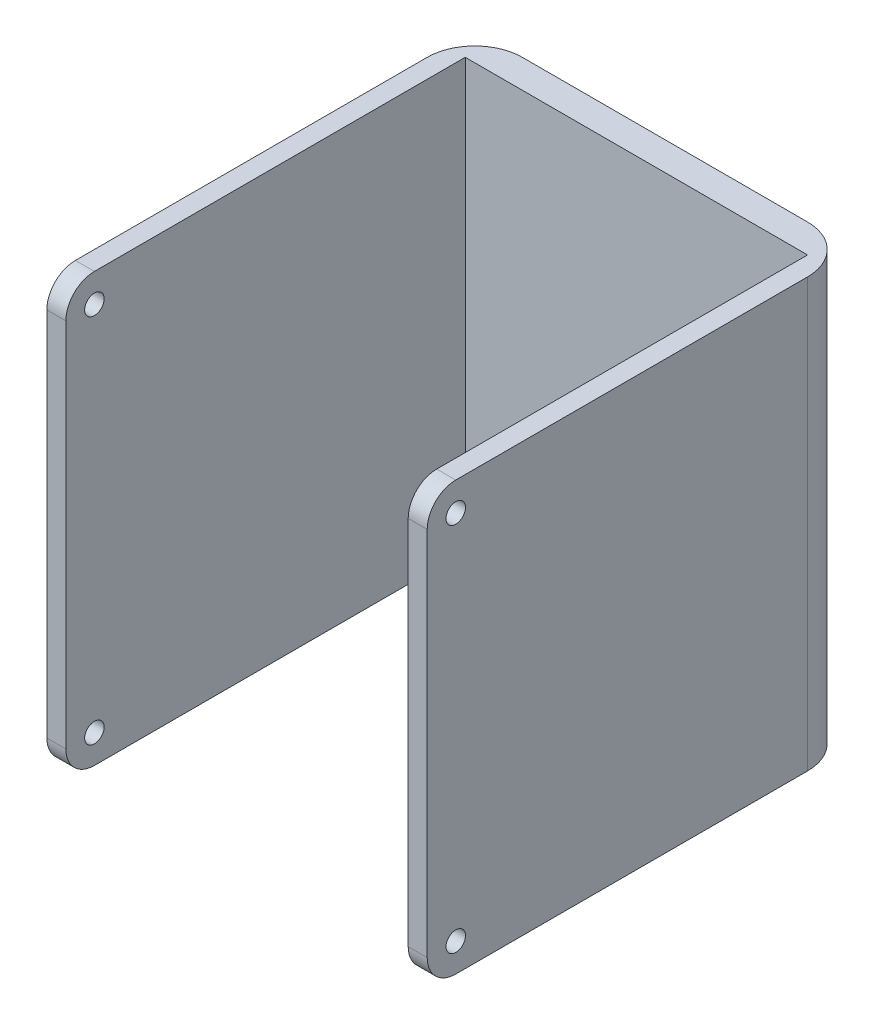
ISO-10303-21;
HEADER;
FILE_DESCRIPTION(('STEP AP214'),'2;1');
FILE_NAME('part.step','',(''),(''),'','','');
FILE_SCHEMA(('AUTOMOTIVE_DESIGN { 1 0 10303 214 1 1 1 1 }'));
ENDSEC;
DATA;
#1=APPLICATION_CONTEXT('core data for automotive mechanical design processes');
#2=APPLICATION_PROTOCOL_DEFINITION('international standard','automotive_design',2000,#1);
#3=PRODUCT_CONTEXT('',#1,'mechanical');
#4=PRODUCT('Part','Part','',(#3));
#5=PRODUCT_RELATED_PRODUCT_CATEGORY('part','',(#4));
#6=PRODUCT_DEFINITION_FORMATION('','',#4);
#7=PRODUCT_DEFINITION_CONTEXT('part definition',#1,'design');
#8=PRODUCT_DEFINITION('design','',#6,#7);
#9=PRODUCT_DEFINITION_SHAPE('','',#8);
#10=(LENGTH_UNIT() NAMED_UNIT(*) SI_UNIT(.MILLI.,.METRE.));
#11=(NAMED_UNIT(*) PLANE_ANGLE_UNIT() SI_UNIT($,.RADIAN.));
#12=(NAMED_UNIT(*) SI_UNIT($,.STERADIAN.) SOLID_ANGLE_UNIT());
#13=UNCERTAINTY_MEASURE_WITH_UNIT(LENGTH_MEASURE(1.E-05),#10,'distance_accuracy_value','');
#14=(GEOMETRIC_REPRESENTATION_CONTEXT(3) GLOBAL_UNCERTAINTY_ASSIGNED_CONTEXT((#13)) GLOBAL_UNIT_ASSIGNED_CONTEXT((#10,
#11,#12)) REPRESENTATION_CONTEXT('',''));
#15=CARTESIAN_POINT('',(0.,0.,0.));
#16=DIRECTION('',(0.,0.,1.));
#17=DIRECTION('',(1.,0.,0.));
#18=AXIS2_PLACEMENT_3D('',#15,#16,#17);
#19=CARTESIAN_POINT('',(-14.5454545454545,13.9090909090909,37.));
#20=DIRECTION('',(1.,0.,0.));
#21=DIRECTION('',(0.,0.,-1.));
#22=AXIS2_PLACEMENT_3D('',#19,#20,#21);
#23=CYLINDRICAL_SURFACE('',#22,3.);
#24=DIRECTION('',(1.,0.,0.));
#25=VECTOR('',#24,1.);
#26=CARTESIAN_POINT('',(-14.5454545454545,16.9090909090909,37.));
#27=LINE('',#26,#25);
#28=CARTESIAN_POINT('',(23.4545454545455,16.9090909090909,37.));
#29=VERTEX_POINT('',#28);
#30=CARTESIAN_POINT('',(25.4545454545455,16.9090909090909,37.));
#31=VERTEX_POINT('',#30);
#32=EDGE_CURVE('E265',#29,#31,#27,.T.);
#33=ORIENTED_EDGE('',*,*,#32,.F.);
#34=CARTESIAN_POINT('',(23.4545454545455,13.9090909090909,37.));
#35=DIRECTION('',(1.,0.,0.));
#36=DIRECTION('',(0.,0.,-1.));
#37=AXIS2_PLACEMENT_3D('',#34,#35,#36);
#38=CIRCLE('',#37,3.);
#39=CARTESIAN_POINT('',(23.4545454545455,13.9090909090909,40.));
#40=VERTEX_POINT('',#39);
#41=EDGE_CURVE('E45',#40,#29,#38,.F.);
#42=ORIENTED_EDGE('',*,*,#41,.F.);
#43=DIRECTION('',(1.,0.,0.));
#44=VECTOR('',#43,1.);
#45=CARTESIAN_POINT('',(0.,13.9090909090909,40.));
#46=LINE('',#45,#44);
#47=CARTESIAN_POINT('',(25.4545454545455,13.9090909090909,40.));
#48=VERTEX_POINT('',#47);
#49=EDGE_CURVE('E268',#48,#40,#46,.F.);
#50=ORIENTED_EDGE('',*,*,#49,.F.);
#51=CARTESIAN_POINT('',(25.4545454545455,13.9090909090909,37.));
#52=DIRECTION('',(-1.,0.,0.));
#53=DIRECTION('',(0.,-1.,0.));
#54=AXIS2_PLACEMENT_3D('',#51,#52,#53);
#55=CIRCLE('',#54,3.);
#56=EDGE_CURVE('E11',#31,#48,#55,.F.);
#57=ORIENTED_EDGE('',*,*,#56,.F.);
#58=EDGE_LOOP('',(#33,#42,#50,#57));
#59=FACE_BOUND('',#58,.T.);
#60=ADVANCED_FACE('F38',(#59),#23,.T.);
#61=CARTESIAN_POINT('',(-14.5454545454545,13.9090909090909,37.));
#62=DIRECTION('',(1.,0.,0.));
#63=DIRECTION('',(0.,0.,-1.));
#64=AXIS2_PLACEMENT_3D('',#61,#62,#63);
#65=CYLINDRICAL_SURFACE('',#64,3.);
#66=DIRECTION('',(1.,0.,0.));
#67=VECTOR('',#66,1.);
#68=CARTESIAN_POINT('',(-14.5454545454545,16.9090909090909,37.));
#69=LINE('',#68,#67);
#70=CARTESIAN_POINT('',(-14.5454545454545,16.9090909090909,37.));
#71=VERTEX_POINT('',#70);
#72=CARTESIAN_POINT('',(-12.5454545454545,16.9090909090909,37.));
#73=VERTEX_POINT('',#72);
#74=EDGE_CURVE('E254',#71,#73,#69,.T.);
#75=ORIENTED_EDGE('',*,*,#74,.F.);
#76=CARTESIAN_POINT('',(-14.5454545454545,13.9090909090909,37.));
#77=DIRECTION('',(-1.,0.,0.));
#78=DIRECTION('',(0.,-1.,0.));
#79=AXIS2_PLACEMENT_3D('',#76,#77,#78);
#80=CIRCLE('',#79,3.);
#81=CARTESIAN_POINT('',(-14.5454545454545,13.9090909090909,40.));
#82=VERTEX_POINT('',#81);
#83=EDGE_CURVE('E263',#82,#71,#80,.T.);
#84=ORIENTED_EDGE('',*,*,#83,.F.);
#85=DIRECTION('',(1.,0.,0.));
#86=VECTOR('',#85,1.);
#87=CARTESIAN_POINT('',(0.,13.9090909090909,40.));
#88=LINE('',#87,#86);
#89=CARTESIAN_POINT('',(-12.5454545454545,13.9090909090909,40.));
#90=VERTEX_POINT('',#89);
#91=EDGE_CURVE('E260',#90,#82,#88,.F.);
#92=ORIENTED_EDGE('',*,*,#91,.F.);
#93=CARTESIAN_POINT('',(-12.5454545454545,13.9090909090909,37.));
#94=DIRECTION('',(-1.,0.,0.));
#95=DIRECTION('',(0.,0.,1.));
#96=AXIS2_PLACEMENT_3D('',#93,#94,#95);
#97=CIRCLE('',#96,3.);
#98=EDGE_CURVE('E257',#73,#90,#97,.F.);
#99=ORIENTED_EDGE('',*,*,#98,.F.);
#100=EDGE_LOOP('',(#75,#84,#92,#99));
#101=FACE_BOUND('',#100,.T.);
#102=ADVANCED_FACE('F325',(#101),#65,.T.);
#103=CARTESIAN_POINT('',(-14.5454545454545,-25.0909090909091,37.));
#104=DIRECTION('',(1.,0.,0.));
#105=DIRECTION('',(0.,0.,-1.));
#106=AXIS2_PLACEMENT_3D('',#103,#104,#105);
#107=CYLINDRICAL_SURFACE('',#106,3.);
#108=DIRECTION('',(-1.,0.,0.));
#109=VECTOR('',#108,1.);
#110=CARTESIAN_POINT('',(-14.5454545454545,-28.0909090909091,37.));
#111=LINE('',#110,#109);
#112=CARTESIAN_POINT('',(25.4545454545455,-28.0909090909091,37.));
#113=VERTEX_POINT('',#112);
#114=CARTESIAN_POINT('',(23.4545454545455,-28.0909090909091,37.));
#115=VERTEX_POINT('',#114);
#116=EDGE_CURVE('E243',#113,#115,#111,.T.);
#117=ORIENTED_EDGE('',*,*,#116,.F.);
#118=CARTESIAN_POINT('',(25.4545454545455,-25.0909090909091,37.));
#119=DIRECTION('',(-1.,0.,0.));
#120=DIRECTION('',(0.,-1.,0.));
#121=AXIS2_PLACEMENT_3D('',#118,#119,#120);
#122=CIRCLE('',#121,3.);
#123=CARTESIAN_POINT('',(25.4545454545455,-25.0909090909091,40.));
#124=VERTEX_POINT('',#123);
#125=EDGE_CURVE('E249',#124,#113,#122,.F.);
#126=ORIENTED_EDGE('',*,*,#125,.F.);
#127=DIRECTION('',(-1.,0.,0.));
#128=VECTOR('',#127,1.);
#129=CARTESIAN_POINT('',(-14.5454545454545,-25.0909090909091,40.));
#130=LINE('',#129,#128);
#131=CARTESIAN_POINT('',(23.4545454545455,-25.0909090909091,40.));
#132=VERTEX_POINT('',#131);
#133=EDGE_CURVE('E246',#132,#124,#130,.F.);
#134=ORIENTED_EDGE('',*,*,#133,.F.);
#135=CARTESIAN_POINT('',(23.4545454545455,-25.0909090909091,37.));
#136=DIRECTION('',(1.,0.,0.));
#137=DIRECTION('',(0.,0.,-1.));
#138=AXIS2_PLACEMENT_3D('',#135,#136,#137);
#139=CIRCLE('',#138,3.);
#140=EDGE_CURVE('E251',#115,#132,#139,.F.);
#141=ORIENTED_EDGE('',*,*,#140,.F.);
#142=EDGE_LOOP('',(#117,#126,#134,#141));
#143=FACE_BOUND('',#142,.T.);
#144=ADVANCED_FACE('F329',(#143),#107,.T.);
#145=CARTESIAN_POINT('',(-14.5454545454545,-25.0909090909091,37.));
#146=DIRECTION('',(1.,0.,0.));
#147=DIRECTION('',(0.,0.,-1.));
#148=AXIS2_PLACEMENT_3D('',#145,#146,#147);
#149=CYLINDRICAL_SURFACE('',#148,3.);
#150=DIRECTION('',(-1.,0.,0.));
#151=VECTOR('',#150,1.);
#152=CARTESIAN_POINT('',(-14.5454545454545,-28.0909090909091,37.));
#153=LINE('',#152,#151);
#154=CARTESIAN_POINT('',(-12.5454545454545,-28.0909090909091,37.));
#155=VERTEX_POINT('',#154);
#156=CARTESIAN_POINT('',(-14.5454545454545,-28.0909090909091,37.));
#157=VERTEX_POINT('',#156);
#158=EDGE_CURVE('E232',#155,#157,#153,.T.);
#159=ORIENTED_EDGE('',*,*,#158,.F.);
#160=CARTESIAN_POINT('',(-12.5454545454545,-25.0909090909091,37.));
#161=DIRECTION('',(-1.,0.,0.));
#162=DIRECTION('',(0.,0.,1.));
#163=AXIS2_PLACEMENT_3D('',#160,#161,#162);
#164=CIRCLE('',#163,3.);
#165=CARTESIAN_POINT('',(-12.5454545454545,-25.0909090909091,40.));
#166=VERTEX_POINT('',#165);
#167=EDGE_CURVE('E238',#166,#155,#164,.F.);
#168=ORIENTED_EDGE('',*,*,#167,.F.);
#169=DIRECTION('',(-1.,0.,0.));
#170=VECTOR('',#169,1.);
#171=CARTESIAN_POINT('',(-14.5454545454545,-25.0909090909091,40.));
#172=LINE('',#171,#170);
#173=CARTESIAN_POINT('',(-14.5454545454545,-25.0909090909091,40.));
#174=VERTEX_POINT('',#173);
#175=EDGE_CURVE('E235',#174,#166,#172,.F.);
#176=ORIENTED_EDGE('',*,*,#175,.F.);
#177=CARTESIAN_POINT('',(-14.5454545454545,-25.0909090909091,37.));
#178=DIRECTION('',(-1.,0.,0.));
#179=DIRECTION('',(0.,-1.,0.));
#180=AXIS2_PLACEMENT_3D('',#177,#178,#179);
#181=CIRCLE('',#180,3.);
#182=EDGE_CURVE('E240',#157,#174,#181,.T.);
#183=ORIENTED_EDGE('',*,*,#182,.F.);
#184=EDGE_LOOP('',(#159,#168,#176,#183));
#185=FACE_BOUND('',#184,.T.);
#186=ADVANCED_FACE('F334',(#185),#149,.T.);
#187=CARTESIAN_POINT('',(20.4545454545455,0.,0.));
#188=DIRECTION('',(0.,1.,0.));
#189=DIRECTION('',(-1.,0.,0.));
#190=AXIS2_PLACEMENT_3D('',#187,#188,#189);
#191=CYLINDRICAL_SURFACE('',#190,5.);
#192=DIRECTION('',(0.,-1.,0.));
#193=VECTOR('',#192,1.);
#194=CARTESIAN_POINT('',(20.4545454545455,0.,-5.));
#195=LINE('',#194,#193);
#196=CARTESIAN_POINT('',(20.4545454545455,16.9090909090909,-5.));
#197=VERTEX_POINT('',#196);
#198=CARTESIAN_POINT('',(20.4545454545455,-28.0909090909091,-5.));
#199=VERTEX_POINT('',#198);
#200=EDGE_CURVE('E222',#197,#199,#195,.T.);
#201=ORIENTED_EDGE('',*,*,#200,.F.);
#202=CARTESIAN_POINT('',(20.4545454545455,16.9090909090909,0.));
#203=DIRECTION('',(0.,-1.,0.));
#204=DIRECTION('',(0.,0.,-1.));
#205=AXIS2_PLACEMENT_3D('',#202,#203,#204);
#206=CIRCLE('',#205,5.);
#207=CARTESIAN_POINT('',(25.4545454545455,16.9090909090909,0.));
#208=VERTEX_POINT('',#207);
#209=EDGE_CURVE('E228',#208,#197,#206,.F.);
#210=ORIENTED_EDGE('',*,*,#209,.F.);
#211=DIRECTION('',(0.,-1.,0.));
#212=VECTOR('',#211,1.);
#213=CARTESIAN_POINT('',(25.4545454545455,0.,0.));
#214=LINE('',#213,#212);
#215=CARTESIAN_POINT('',(25.4545454545455,-28.0909090909091,0.));
#216=VERTEX_POINT('',#215);
#217=EDGE_CURVE('E225',#216,#208,#214,.F.);
#218=ORIENTED_EDGE('',*,*,#217,.F.);
#219=CARTESIAN_POINT('',(20.4545454545455,-28.0909090909091,0.));
#220=DIRECTION('',(0.,-1.,0.));
#221=DIRECTION('',(0.,0.,-1.));
#222=AXIS2_PLACEMENT_3D('',#219,#220,#221);
#223=CIRCLE('',#222,5.);
#224=EDGE_CURVE('E230',#199,#216,#223,.T.);
#225=ORIENTED_EDGE('',*,*,#224,.F.);
#226=EDGE_LOOP('',(#201,#210,#218,#225));
#227=FACE_BOUND('',#226,.T.);
#228=ADVANCED_FACE('F341',(#227),#191,.T.);
#229=CARTESIAN_POINT('',(-9.54545454545454,0.,0.));
#230=DIRECTION('',(0.,1.,0.));
#231=DIRECTION('',(-1.,0.,0.));
#232=AXIS2_PLACEMENT_3D('',#229,#230,#231);
#233=CYLINDRICAL_SURFACE('',#232,5.);
#234=DIRECTION('',(0.,1.,0.));
#235=VECTOR('',#234,1.);
#236=CARTESIAN_POINT('',(-9.54545454545454,0.,-5.));
#237=LINE('',#236,#235);
#238=CARTESIAN_POINT('',(-9.54545454545454,-28.0909090909091,-5.));
#239=VERTEX_POINT('',#238);
#240=CARTESIAN_POINT('',(-9.54545454545455,16.9090909090909,-5.));
#241=VERTEX_POINT('',#240);
#242=EDGE_CURVE('E212',#239,#241,#237,.T.);
#243=ORIENTED_EDGE('',*,*,#242,.F.);
#244=CARTESIAN_POINT('',(-9.54545454545454,-28.0909090909091,0.));
#245=DIRECTION('',(0.,-1.,0.));
#246=DIRECTION('',(0.,0.,-1.));
#247=AXIS2_PLACEMENT_3D('',#244,#245,#246);
#248=CIRCLE('',#247,5.);
#249=CARTESIAN_POINT('',(-14.5454545454545,-28.0909090909091,0.));
#250=VERTEX_POINT('',#249);
#251=EDGE_CURVE('E218',#250,#239,#248,.T.);
#252=ORIENTED_EDGE('',*,*,#251,.F.);
#253=DIRECTION('',(0.,1.,0.));
#254=VECTOR('',#253,1.);
#255=CARTESIAN_POINT('',(-14.5454545454545,16.9090909090909,0.));
#256=LINE('',#255,#254);
#257=CARTESIAN_POINT('',(-14.5454545454545,16.9090909090909,0.));
#258=VERTEX_POINT('',#257);
#259=EDGE_CURVE('E215',#258,#250,#256,.F.);
#260=ORIENTED_EDGE('',*,*,#259,.F.);
#261=CARTESIAN_POINT('',(-9.54545454545454,16.9090909090909,0.));
#262=DIRECTION('',(0.,-1.,0.));
#263=DIRECTION('',(0.,0.,-1.));
#264=AXIS2_PLACEMENT_3D('',#261,#262,#263);
#265=CIRCLE('',#264,5.);
#266=EDGE_CURVE('E220',#241,#258,#265,.F.);
#267=ORIENTED_EDGE('',*,*,#266,.F.);
#268=EDGE_LOOP('',(#243,#252,#260,#267));
#269=FACE_BOUND('',#268,.T.);
#270=ADVANCED_FACE('F345',(#269),#233,.T.);
#271=CARTESIAN_POINT('',(0.,0.,40.));
#272=DIRECTION('',(0.,0.,-1.));
#273=DIRECTION('',(-1.,0.,0.));
#274=AXIS2_PLACEMENT_3D('',#271,#272,#273);
#275=PLANE('',#274);
#276=DIRECTION('',(0.,1.,0.));
#277=VECTOR('',#276,1.);
#278=CARTESIAN_POINT('',(-12.5454545454545,0.,40.));
#279=LINE('',#278,#277);
#280=EDGE_CURVE('E207',#166,#90,#279,.T.);
#281=ORIENTED_EDGE('',*,*,#280,.T.);
#282=ORIENTED_EDGE('',*,*,#91,.T.);
#283=DIRECTION('',(0.,-1.,0.));
#284=VECTOR('',#283,1.);
#285=CARTESIAN_POINT('',(-14.5454545454545,16.9090909090909,40.));
#286=LINE('',#285,#284);
#287=EDGE_CURVE('E186',#82,#174,#286,.T.);
#288=ORIENTED_EDGE('',*,*,#287,.T.);
#289=ORIENTED_EDGE('',*,*,#175,.T.);
#290=EDGE_LOOP('',(#281,#282,#288,#289));
#291=FACE_BOUND('',#290,.T.);
#292=ADVANCED_FACE('F349',(#291),#275,.F.);
#293=CARTESIAN_POINT('',(-14.5454545454545,16.9090909090909,-5.));
#294=DIRECTION('',(0.,-1.,0.));
#295=DIRECTION('',(0.,0.,-1.));
#296=AXIS2_PLACEMENT_3D('',#293,#294,#295);
#297=PLANE('',#296);
#298=DIRECTION('',(0.,0.,-1.));
#299=VECTOR('',#298,1.);
#300=CARTESIAN_POINT('',(23.4545454545455,16.9090909090909,3.));
#301=LINE('',#300,#299);
#302=CARTESIAN_POINT('',(23.4545454545454,16.9090909090909,-2.));
#303=VERTEX_POINT('',#302);
#304=EDGE_CURVE('E178',#29,#303,#301,.T.);
#305=ORIENTED_EDGE('',*,*,#304,.F.);
#306=ORIENTED_EDGE('',*,*,#32,.T.);
#307=DIRECTION('',(0.,0.,1.));
#308=VECTOR('',#307,1.);
#309=CARTESIAN_POINT('',(25.4545454545455,16.9090909090909,-5.));
#310=LINE('',#309,#308);
#311=EDGE_CURVE('E203',#208,#31,#310,.T.);
#312=ORIENTED_EDGE('',*,*,#311,.F.);
#313=ORIENTED_EDGE('',*,*,#209,.T.);
#314=DIRECTION('',(1.,0.,0.));
#315=VECTOR('',#314,1.);
#316=CARTESIAN_POINT('',(-14.5454545454545,16.9090909090909,-5.));
#317=LINE('',#316,#315);
#318=EDGE_CURVE('E188',#241,#197,#317,.T.);
#319=ORIENTED_EDGE('',*,*,#318,.F.);
#320=ORIENTED_EDGE('',*,*,#266,.T.);
#321=DIRECTION('',(0.,0.,1.));
#322=VECTOR('',#321,1.);
#323=CARTESIAN_POINT('',(-14.5454545454545,16.9090909090909,-5.));
#324=LINE('',#323,#322);
#325=EDGE_CURVE('E194',#258,#71,#324,.T.);
#326=ORIENTED_EDGE('',*,*,#325,.T.);
#327=ORIENTED_EDGE('',*,*,#74,.T.);
#328=DIRECTION('',(0.,0.,1.));
#329=VECTOR('',#328,1.);
#330=CARTESIAN_POINT('',(-12.5454545454545,16.9090909090909,3.));
#331=LINE('',#330,#329);
#332=CARTESIAN_POINT('',(-12.5454545454545,16.9090909090909,-2.));
#333=VERTEX_POINT('',#332);
#334=EDGE_CURVE('E279',#333,#73,#331,.T.);
#335=ORIENTED_EDGE('',*,*,#334,.F.);
#336=DIRECTION('',(-1.,0.,0.));
#337=VECTOR('',#336,1.);
#338=CARTESIAN_POINT('',(-12.5454545454545,16.9090909090909,-2.));
#339=LINE('',#338,#337);
#340=EDGE_CURVE('E158',#303,#333,#339,.T.);
#341=ORIENTED_EDGE('',*,*,#340,.F.);
#342=EDGE_LOOP('',(#305,#306,#312,#313,#319,#320,#326,#327,#335,#341));
#343=FACE_BOUND('',#342,.T.);
#344=ADVANCED_FACE('F277',(#343),#297,.F.);
#345=CARTESIAN_POINT('',(25.4545454545455,16.9090909090909,-5.));
#346=DIRECTION('',(-1.,0.,0.));
#347=DIRECTION('',(0.,-1.,0.));
#348=AXIS2_PLACEMENT_3D('',#345,#346,#347);
#349=PLANE('',#348);
#350=CARTESIAN_POINT('',(25.4545454545455,13.9090909090909,37.));
#351=DIRECTION('',(1.,0.,0.));
#352=DIRECTION('',(0.,1.,0.));
#353=AXIS2_PLACEMENT_3D('',#350,#351,#352);
#354=CIRCLE('',#353,1.025);
#355=CARTESIAN_POINT('',(25.4545454545455,14.9340909090909,37.));
#356=VERTEX_POINT('',#355);
#357=EDGE_CURVE('E301',#356,#356,#354,.T.);
#358=ORIENTED_EDGE('',*,*,#357,.F.);
#359=EDGE_LOOP('',(#358));
#360=FACE_BOUND('',#359,.T.);
#361=CARTESIAN_POINT('',(25.4545454545455,-25.0909090909091,37.));
#362=DIRECTION('',(1.,0.,0.));
#363=DIRECTION('',(0.,1.,0.));
#364=AXIS2_PLACEMENT_3D('',#361,#362,#363);
#365=CIRCLE('',#364,1.025);
#366=CARTESIAN_POINT('',(25.4545454545455,-24.0659090909091,37.));
#367=VERTEX_POINT('',#366);
#368=EDGE_CURVE('E294',#367,#367,#365,.T.);
#369=ORIENTED_EDGE('',*,*,#368,.F.);
#370=EDGE_LOOP('',(#369));
#371=FACE_BOUND('',#370,.T.);
#372=ORIENTED_EDGE('',*,*,#311,.T.);
#373=ORIENTED_EDGE('',*,*,#56,.T.);
#374=DIRECTION('',(0.,-1.,0.));
#375=VECTOR('',#374,1.);
#376=CARTESIAN_POINT('',(25.4545454545455,16.9090909090909,40.));
#377=LINE('',#376,#375);
#378=EDGE_CURVE('E184',#48,#124,#377,.T.);
#379=ORIENTED_EDGE('',*,*,#378,.T.);
#380=ORIENTED_EDGE('',*,*,#125,.T.);
#381=DIRECTION('',(0.,0.,1.));
#382=VECTOR('',#381,1.);
#383=CARTESIAN_POINT('',(25.4545454545455,-28.0909090909091,-5.));
#384=LINE('',#383,#382);
#385=EDGE_CURVE('E200',#216,#113,#384,.T.);
#386=ORIENTED_EDGE('',*,*,#385,.F.);
#387=ORIENTED_EDGE('',*,*,#217,.T.);
#388=EDGE_LOOP('',(#372,#373,#379,#380,#386,#387));
#389=FACE_BOUND('',#388,.T.);
#390=ADVANCED_FACE('F353',(#360,#371,#389),#349,.F.);
#391=CARTESIAN_POINT('',(-14.5454545454545,-28.0909090909091,-5.));
#392=DIRECTION('',(0.,-1.,0.));
#393=DIRECTION('',(0.,0.,-1.));
#394=AXIS2_PLACEMENT_3D('',#391,#392,#393);
#395=PLANE('',#394);
#396=ORIENTED_EDGE('',*,*,#385,.T.);
#397=ORIENTED_EDGE('',*,*,#116,.T.);
#398=DIRECTION('',(0.,0.,1.));
#399=VECTOR('',#398,1.);
#400=CARTESIAN_POINT('',(23.4545454545455,-28.0909090909091,-5.00000000000001));
#401=LINE('',#400,#399);
#402=CARTESIAN_POINT('',(23.4545454545455,-28.0909090909091,3.));
#403=VERTEX_POINT('',#402);
#404=EDGE_CURVE('E174',#403,#115,#401,.T.);
#405=ORIENTED_EDGE('',*,*,#404,.F.);
#406=DIRECTION('',(1.,0.,0.));
#407=VECTOR('',#406,1.);
#408=CARTESIAN_POINT('',(-14.5454545454545,-28.0909090909091,3.));
#409=LINE('',#408,#407);
#410=CARTESIAN_POINT('',(-12.5454545454545,-28.0909090909091,3.));
#411=VERTEX_POINT('',#410);
#412=EDGE_CURVE('E210',#411,#403,#409,.T.);
#413=ORIENTED_EDGE('',*,*,#412,.F.);
#414=DIRECTION('',(0.,0.,-1.));
#415=VECTOR('',#414,1.);
#416=CARTESIAN_POINT('',(-12.5454545454545,-28.0909090909091,-5.));
#417=LINE('',#416,#415);
#418=EDGE_CURVE('E173',#155,#411,#417,.T.);
#419=ORIENTED_EDGE('',*,*,#418,.F.);
#420=ORIENTED_EDGE('',*,*,#158,.T.);
#421=DIRECTION('',(0.,0.,1.));
#422=VECTOR('',#421,1.);
#423=CARTESIAN_POINT('',(-14.5454545454545,-28.0909090909091,-5.));
#424=LINE('',#423,#422);
#425=EDGE_CURVE('E197',#250,#157,#424,.T.);
#426=ORIENTED_EDGE('',*,*,#425,.F.);
#427=ORIENTED_EDGE('',*,*,#251,.T.);
#428=DIRECTION('',(1.,0.,0.));
#429=VECTOR('',#428,1.);
#430=CARTESIAN_POINT('',(-14.5454545454545,-28.0909090909091,-5.));
#431=LINE('',#430,#429);
#432=EDGE_CURVE('E191',#239,#199,#431,.T.);
#433=ORIENTED_EDGE('',*,*,#432,.T.);
#434=ORIENTED_EDGE('',*,*,#224,.T.);
#435=EDGE_LOOP('',(#396,#397,#405,#413,#419,#420,#426,#427,#433,#434));
#436=FACE_BOUND('',#435,.T.);
#437=ADVANCED_FACE('F356',(#436),#395,.T.);
#438=CARTESIAN_POINT('',(-14.5454545454545,16.9090909090909,-5.));
#439=DIRECTION('',(-1.,0.,0.));
#440=DIRECTION('',(0.,-1.,0.));
#441=AXIS2_PLACEMENT_3D('',#438,#439,#440);
#442=PLANE('',#441);
#443=CARTESIAN_POINT('',(-14.5454545454545,13.9090909090909,37.));
#444=DIRECTION('',(-1.,0.,0.));
#445=DIRECTION('',(0.,-1.,0.));
#446=AXIS2_PLACEMENT_3D('',#443,#444,#445);
#447=CIRCLE('',#446,1.025);
#448=CARTESIAN_POINT('',(-14.5454545454545,12.8840909090909,37.));
#449=VERTEX_POINT('',#448);
#450=EDGE_CURVE('E282',#449,#449,#447,.T.);
#451=ORIENTED_EDGE('',*,*,#450,.F.);
#452=EDGE_LOOP('',(#451));
#453=FACE_BOUND('',#452,.T.);
#454=CARTESIAN_POINT('',(-14.5454545454545,-25.0909090909091,37.));
#455=DIRECTION('',(-1.,0.,0.));
#456=DIRECTION('',(0.,-1.,0.));
#457=AXIS2_PLACEMENT_3D('',#454,#455,#456);
#458=CIRCLE('',#457,1.025);
#459=CARTESIAN_POINT('',(-14.5454545454545,-26.1159090909091,37.));
#460=VERTEX_POINT('',#459);
#461=EDGE_CURVE('E285',#460,#460,#458,.T.);
#462=ORIENTED_EDGE('',*,*,#461,.F.);
#463=EDGE_LOOP('',(#462));
#464=FACE_BOUND('',#463,.T.);
#465=ORIENTED_EDGE('',*,*,#287,.F.);
#466=ORIENTED_EDGE('',*,*,#83,.T.);
#467=ORIENTED_EDGE('',*,*,#325,.F.);
#468=ORIENTED_EDGE('',*,*,#259,.T.);
#469=ORIENTED_EDGE('',*,*,#425,.T.);
#470=ORIENTED_EDGE('',*,*,#182,.T.);
#471=EDGE_LOOP('',(#465,#466,#467,#468,#469,#470));
#472=FACE_BOUND('',#471,.T.);
#473=ADVANCED_FACE('F360',(#453,#464,#472),#442,.T.);
#474=CARTESIAN_POINT('',(0.,0.,-5.));
#475=DIRECTION('',(0.,0.,-1.));
#476=DIRECTION('',(-1.,0.,0.));
#477=AXIS2_PLACEMENT_3D('',#474,#475,#476);
#478=PLANE('',#477);
#479=ORIENTED_EDGE('',*,*,#318,.T.);
#480=ORIENTED_EDGE('',*,*,#200,.T.);
#481=ORIENTED_EDGE('',*,*,#432,.F.);
#482=ORIENTED_EDGE('',*,*,#242,.T.);
#483=EDGE_LOOP('',(#479,#480,#481,#482));
#484=FACE_BOUND('',#483,.T.);
#485=ADVANCED_FACE('F364',(#484),#478,.T.);
#486=ORIENTED_EDGE('',*,*,#378,.F.);
#487=ORIENTED_EDGE('',*,*,#49,.T.);
#488=DIRECTION('',(0.,-1.,0.));
#489=VECTOR('',#488,1.);
#490=CARTESIAN_POINT('',(23.4545454545455,0.,40.));
#491=LINE('',#490,#489);
#492=EDGE_CURVE('E205',#40,#132,#491,.T.);
#493=ORIENTED_EDGE('',*,*,#492,.T.);
#494=ORIENTED_EDGE('',*,*,#133,.T.);
#495=EDGE_LOOP('',(#486,#487,#493,#494));
#496=FACE_BOUND('',#495,.T.);
#497=ADVANCED_FACE('F368',(#496),#275,.F.);
#498=CARTESIAN_POINT('',(-12.5454545454545,-33.0909090909091,3.));
#499=DIRECTION('',(-1.,0.,0.));
#500=DIRECTION('',(0.,0.,1.));
#501=AXIS2_PLACEMENT_3D('',#498,#499,#500);
#502=PLANE('',#501);
#503=CARTESIAN_POINT('',(-12.5454545454545,13.9090909090909,37.));
#504=DIRECTION('',(-1.,0.,0.));
#505=DIRECTION('',(0.,-1.,0.));
#506=AXIS2_PLACEMENT_3D('',#503,#504,#505);
#507=CIRCLE('',#506,1.025);
#508=CARTESIAN_POINT('',(-12.5454545454545,12.8840909090909,37.));
#509=VERTEX_POINT('',#508);
#510=EDGE_CURVE('E280',#509,#509,#507,.T.);
#511=ORIENTED_EDGE('',*,*,#510,.T.);
#512=EDGE_LOOP('',(#511));
#513=FACE_BOUND('',#512,.T.);
#514=CARTESIAN_POINT('',(-12.5454545454545,-25.0909090909091,37.));
#515=DIRECTION('',(-1.,0.,0.));
#516=DIRECTION('',(0.,-1.,0.));
#517=AXIS2_PLACEMENT_3D('',#514,#515,#516);
#518=CIRCLE('',#517,1.025);
#519=CARTESIAN_POINT('',(-12.5454545454545,-26.1159090909091,37.));
#520=VERTEX_POINT('',#519);
#521=EDGE_CURVE('E288',#520,#520,#518,.T.);
#522=ORIENTED_EDGE('',*,*,#521,.T.);
#523=EDGE_LOOP('',(#522));
#524=FACE_BOUND('',#523,.T.);
#525=ORIENTED_EDGE('',*,*,#334,.T.);
#526=ORIENTED_EDGE('',*,*,#98,.T.);
#527=ORIENTED_EDGE('',*,*,#280,.F.);
#528=ORIENTED_EDGE('',*,*,#167,.T.);
#529=ORIENTED_EDGE('',*,*,#418,.T.);
#530=DIRECTION('',(0.,1.,0.));
#531=VECTOR('',#530,1.);
#532=CARTESIAN_POINT('',(-12.5454545454545,-33.0909090909091,3.));
#533=LINE('',#532,#531);
#534=CARTESIAN_POINT('',(-12.5454545454545,-26.0909090909091,3.));
#535=VERTEX_POINT('',#534);
#536=EDGE_CURVE('E164',#411,#535,#533,.T.);
#537=ORIENTED_EDGE('',*,*,#536,.T.);
#538=DIRECTION('',(0.,0.,1.));
#539=VECTOR('',#538,1.);
#540=CARTESIAN_POINT('',(-12.5454545454545,-26.0909090909091,3.));
#541=LINE('',#540,#539);
#542=CARTESIAN_POINT('',(-12.5454545454545,-26.0909090909091,-2.));
#543=VERTEX_POINT('',#542);
#544=EDGE_CURVE('E147',#543,#535,#541,.T.);
#545=ORIENTED_EDGE('',*,*,#544,.F.);
#546=DIRECTION('',(0.,1.,0.));
#547=VECTOR('',#546,1.);
#548=CARTESIAN_POINT('',(-12.5454545454545,-26.0909090909091,-2.));
#549=LINE('',#548,#547);
#550=EDGE_CURVE('E298',#543,#333,#549,.T.);
#551=ORIENTED_EDGE('',*,*,#550,.T.);
#552=EDGE_LOOP('',(#525,#526,#527,#528,#529,#537,#545,#551));
#553=FACE_BOUND('',#552,.T.);
#554=ADVANCED_FACE('F171',(#513,#524,#553),#502,.F.);
#555=CARTESIAN_POINT('',(-12.5454545454545,-33.0909090909091,3.));
#556=DIRECTION('',(0.,0.,-1.));
#557=DIRECTION('',(-1.,0.,0.));
#558=AXIS2_PLACEMENT_3D('',#555,#556,#557);
#559=PLANE('',#558);
#560=DIRECTION('',(0.,1.,0.));
#561=VECTOR('',#560,1.);
#562=CARTESIAN_POINT('',(23.4545454545455,-33.0909090909091,3.));
#563=LINE('',#562,#561);
#564=CARTESIAN_POINT('',(23.4545454545455,-26.0909090909091,3.));
#565=VERTEX_POINT('',#564);
#566=EDGE_CURVE('E167',#403,#565,#563,.T.);
#567=ORIENTED_EDGE('',*,*,#566,.T.);
#568=DIRECTION('',(1.,0.,0.));
#569=VECTOR('',#568,1.);
#570=CARTESIAN_POINT('',(-12.5454545454545,-26.0909090909091,3.));
#571=LINE('',#570,#569);
#572=EDGE_CURVE('E151',#535,#565,#571,.T.);
#573=ORIENTED_EDGE('',*,*,#572,.F.);
#574=ORIENTED_EDGE('',*,*,#536,.F.);
#575=ORIENTED_EDGE('',*,*,#412,.T.);
#576=EDGE_LOOP('',(#567,#573,#574,#575));
#577=FACE_BOUND('',#576,.T.);
#578=ADVANCED_FACE('F163',(#577),#559,.F.);
#579=CARTESIAN_POINT('',(23.4545454545455,-33.0909090909091,3.));
#580=DIRECTION('',(1.,0.,0.));
#581=DIRECTION('',(0.,0.,-1.));
#582=AXIS2_PLACEMENT_3D('',#579,#580,#581);
#583=PLANE('',#582);
#584=CARTESIAN_POINT('',(23.4545454545455,13.9090909090909,37.));
#585=DIRECTION('',(1.,0.,0.));
#586=DIRECTION('',(0.,1.,0.));
#587=AXIS2_PLACEMENT_3D('',#584,#585,#586);
#588=CIRCLE('',#587,1.025);
#589=CARTESIAN_POINT('',(23.4545454545455,14.9340909090909,37.));
#590=VERTEX_POINT('',#589);
#591=EDGE_CURVE('E289',#590,#590,#588,.T.);
#592=ORIENTED_EDGE('',*,*,#591,.T.);
#593=EDGE_LOOP('',(#592));
#594=FACE_BOUND('',#593,.T.);
#595=CARTESIAN_POINT('',(23.4545454545455,-25.0909090909091,37.));
#596=DIRECTION('',(1.,0.,0.));
#597=DIRECTION('',(0.,1.,0.));
#598=AXIS2_PLACEMENT_3D('',#595,#596,#597);
#599=CIRCLE('',#598,1.025);
#600=CARTESIAN_POINT('',(23.4545454545455,-24.0659090909091,37.));
#601=VERTEX_POINT('',#600);
#602=EDGE_CURVE('E297',#601,#601,#599,.T.);
#603=ORIENTED_EDGE('',*,*,#602,.T.);
#604=EDGE_LOOP('',(#603));
#605=FACE_BOUND('',#604,.T.);
#606=ORIENTED_EDGE('',*,*,#492,.F.);
#607=ORIENTED_EDGE('',*,*,#41,.T.);
#608=ORIENTED_EDGE('',*,*,#304,.T.);
#609=DIRECTION('',(0.,1.,0.));
#610=VECTOR('',#609,1.);
#611=CARTESIAN_POINT('',(23.4545454545454,-26.0909090909091,-2.));
#612=LINE('',#611,#610);
#613=CARTESIAN_POINT('',(23.4545454545454,-26.0909090909091,-2.));
#614=VERTEX_POINT('',#613);
#615=EDGE_CURVE('E306',#614,#303,#612,.T.);
#616=ORIENTED_EDGE('',*,*,#615,.F.);
#617=DIRECTION('',(0.,0.,-1.));
#618=VECTOR('',#617,1.);
#619=CARTESIAN_POINT('',(23.4545454545454,-26.0909090909091,3.));
#620=LINE('',#619,#618);
#621=EDGE_CURVE('E168',#565,#614,#620,.T.);
#622=ORIENTED_EDGE('',*,*,#621,.F.);
#623=ORIENTED_EDGE('',*,*,#566,.F.);
#624=ORIENTED_EDGE('',*,*,#404,.T.);
#625=ORIENTED_EDGE('',*,*,#140,.T.);
#626=EDGE_LOOP('',(#606,#607,#608,#616,#622,#623,#624,#625));
#627=FACE_BOUND('',#626,.T.);
#628=ADVANCED_FACE('F271',(#594,#605,#627),#583,.F.);
#629=CARTESIAN_POINT('',(-12.5454545454545,-25.0909090909091,37.));
#630=DIRECTION('',(-1.,0.,0.));
#631=DIRECTION('',(0.,-1.,0.));
#632=AXIS2_PLACEMENT_3D('',#629,#630,#631);
#633=CYLINDRICAL_SURFACE('',#632,1.025);
#634=ORIENTED_EDGE('',*,*,#521,.F.);
#635=EDGE_LOOP('',(#634));
#636=FACE_BOUND('',#635,.T.);
#637=ORIENTED_EDGE('',*,*,#461,.T.);
#638=EDGE_LOOP('',(#637));
#639=FACE_BOUND('',#638,.T.);
#640=ADVANCED_FACE('F378',(#636,#639),#633,.F.);
#641=CARTESIAN_POINT('',(-12.5454545454545,13.9090909090909,37.));
#642=DIRECTION('',(-1.,0.,0.));
#643=DIRECTION('',(0.,-1.,0.));
#644=AXIS2_PLACEMENT_3D('',#641,#642,#643);
#645=CYLINDRICAL_SURFACE('',#644,1.025);
#646=ORIENTED_EDGE('',*,*,#510,.F.);
#647=EDGE_LOOP('',(#646));
#648=FACE_BOUND('',#647,.T.);
#649=ORIENTED_EDGE('',*,*,#450,.T.);
#650=EDGE_LOOP('',(#649));
#651=FACE_BOUND('',#650,.T.);
#652=ADVANCED_FACE('F384',(#648,#651),#645,.F.);
#653=CARTESIAN_POINT('',(23.4545454545455,-25.0909090909091,37.));
#654=DIRECTION('',(1.,0.,0.));
#655=DIRECTION('',(0.,1.,0.));
#656=AXIS2_PLACEMENT_3D('',#653,#654,#655);
#657=CYLINDRICAL_SURFACE('',#656,1.025);
#658=ORIENTED_EDGE('',*,*,#602,.F.);
#659=EDGE_LOOP('',(#658));
#660=FACE_BOUND('',#659,.T.);
#661=ORIENTED_EDGE('',*,*,#368,.T.);
#662=EDGE_LOOP('',(#661));
#663=FACE_BOUND('',#662,.T.);
#664=ADVANCED_FACE('F321',(#660,#663),#657,.F.);
#665=CARTESIAN_POINT('',(23.4545454545455,13.9090909090909,37.));
#666=DIRECTION('',(1.,0.,0.));
#667=DIRECTION('',(0.,1.,0.));
#668=AXIS2_PLACEMENT_3D('',#665,#666,#667);
#669=CYLINDRICAL_SURFACE('',#668,1.025);
#670=ORIENTED_EDGE('',*,*,#591,.F.);
#671=EDGE_LOOP('',(#670));
#672=FACE_BOUND('',#671,.T.);
#673=ORIENTED_EDGE('',*,*,#357,.T.);
#674=EDGE_LOOP('',(#673));
#675=FACE_BOUND('',#674,.T.);
#676=ADVANCED_FACE('F314',(#672,#675),#669,.F.);
#677=CARTESIAN_POINT('',(-12.5454545454545,-26.0909090909091,-2.));
#678=DIRECTION('',(0.,0.,-1.));
#679=DIRECTION('',(-1.,0.,0.));
#680=AXIS2_PLACEMENT_3D('',#677,#678,#679);
#681=PLANE('',#680);
#682=ORIENTED_EDGE('',*,*,#340,.T.);
#683=ORIENTED_EDGE('',*,*,#550,.F.);
#684=DIRECTION('',(-1.,0.,0.));
#685=VECTOR('',#684,1.);
#686=CARTESIAN_POINT('',(-12.5454545454545,-26.0909090909091,-2.));
#687=LINE('',#686,#685);
#688=EDGE_CURVE('E154',#614,#543,#687,.T.);
#689=ORIENTED_EDGE('',*,*,#688,.F.);
#690=ORIENTED_EDGE('',*,*,#615,.T.);
#691=EDGE_LOOP('',(#682,#683,#689,#690));
#692=FACE_BOUND('',#691,.T.);
#693=ADVANCED_FACE('F312',(#692),#681,.F.);
#694=CARTESIAN_POINT('',(0.,-26.0909090909091,0.));
#695=DIRECTION('',(0.,-1.,0.));
#696=DIRECTION('',(0.,0.,-1.));
#697=AXIS2_PLACEMENT_3D('',#694,#695,#696);
#698=PLANE('',#697);
#699=ORIENTED_EDGE('',*,*,#544,.T.);
#700=ORIENTED_EDGE('',*,*,#572,.T.);
#701=ORIENTED_EDGE('',*,*,#621,.T.);
#702=ORIENTED_EDGE('',*,*,#688,.T.);
#703=EDGE_LOOP('',(#699,#700,#701,#702));
#704=FACE_BOUND('',#703,.T.);
#705=ADVANCED_FACE('F149',(#704),#698,.F.);
#706=CLOSED_SHELL('',(#60,#102,#144,#186,#228,#270,#292,#344,#390,#437,#473,#485,#497,#554,#578,
#628,#640,#652,#664,#676,#693,#705));
#707=MANIFOLD_SOLID_BREP('B2',#706);
#708=ADVANCED_BREP_SHAPE_REPRESENTATION('',(#18,#707),#14);
#709=SHAPE_DEFINITION_REPRESENTATION(#9,#708);
ENDSEC;
END-ISO-10303-21;
